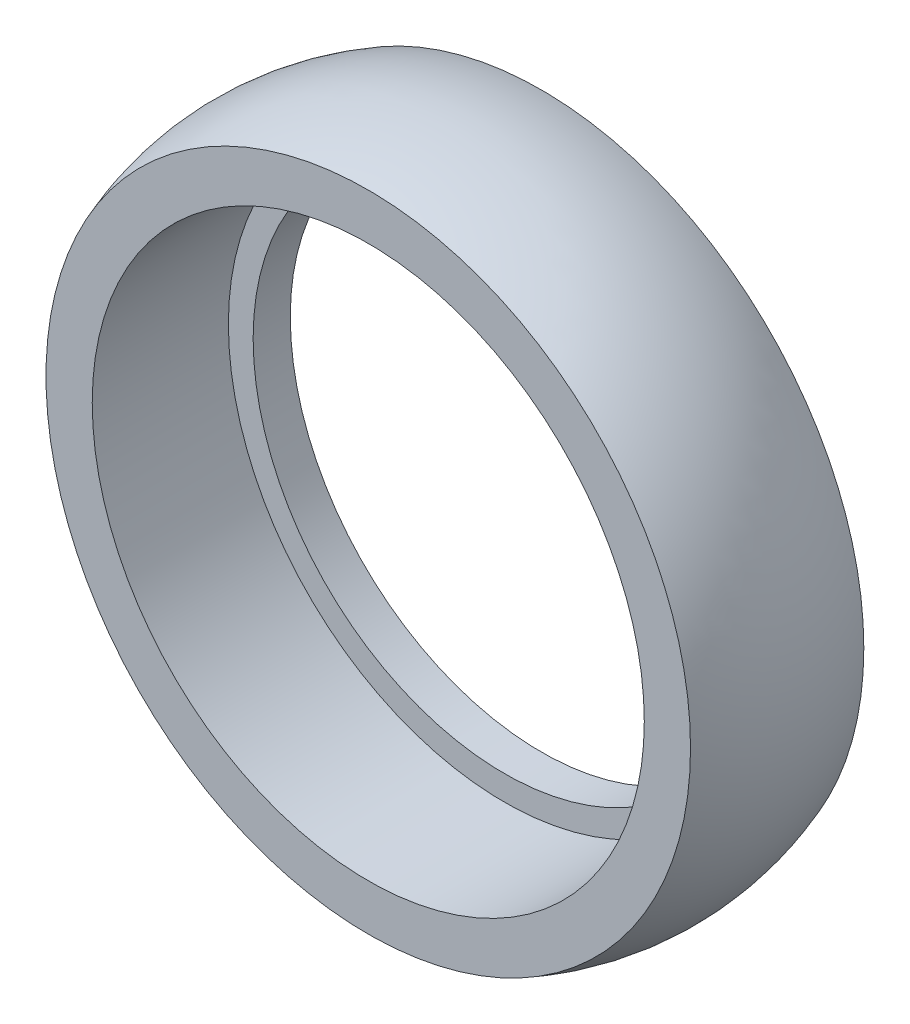
ISO-10303-21;
HEADER;
FILE_DESCRIPTION(('STEP AP214'),'2;1');
FILE_NAME('part.step','',(''),(''),'','','');
FILE_SCHEMA(('AUTOMOTIVE_DESIGN { 1 0 10303 214 1 1 1 1 }'));
ENDSEC;
DATA;
#1=APPLICATION_CONTEXT('core data for automotive mechanical design processes');
#2=APPLICATION_PROTOCOL_DEFINITION('international standard','automotive_design',2000,#1);
#3=PRODUCT_CONTEXT('',#1,'mechanical');
#4=PRODUCT('Part','Part','',(#3));
#5=PRODUCT_RELATED_PRODUCT_CATEGORY('part','',(#4));
#6=PRODUCT_DEFINITION_FORMATION('','',#4);
#7=PRODUCT_DEFINITION_CONTEXT('part definition',#1,'design');
#8=PRODUCT_DEFINITION('design','',#6,#7);
#9=PRODUCT_DEFINITION_SHAPE('','',#8);
#10=(LENGTH_UNIT() NAMED_UNIT(*) SI_UNIT(.MILLI.,.METRE.));
#11=(NAMED_UNIT(*) PLANE_ANGLE_UNIT() SI_UNIT($,.RADIAN.));
#12=(NAMED_UNIT(*) SI_UNIT($,.STERADIAN.) SOLID_ANGLE_UNIT());
#13=UNCERTAINTY_MEASURE_WITH_UNIT(LENGTH_MEASURE(1.E-05),#10,'distance_accuracy_value','');
#14=(GEOMETRIC_REPRESENTATION_CONTEXT(3) GLOBAL_UNCERTAINTY_ASSIGNED_CONTEXT((#13)) GLOBAL_UNIT_ASSIGNED_CONTEXT((#10,
#11,#12)) REPRESENTATION_CONTEXT('',''));
#15=CARTESIAN_POINT('',(0.,0.,0.));
#16=DIRECTION('',(0.,0.,1.));
#17=DIRECTION('',(1.,0.,0.));
#18=AXIS2_PLACEMENT_3D('',#15,#16,#17);
#19=CARTESIAN_POINT('',(0.,0.,3.5));
#20=DIRECTION('',(0.,0.,1.));
#21=DIRECTION('',(1.,0.,0.));
#22=AXIS2_PLACEMENT_3D('',#19,#20,#21);
#23=DEGENERATE_TOROIDAL_SURFACE('',#22,3.65,10.,.T.);
#24=CARTESIAN_POINT('',(0.,0.,7.));
#25=DIRECTION('',(0.,0.,1.));
#26=DIRECTION('',(1.,0.,0.));
#27=AXIS2_PLACEMENT_3D('',#24,#25,#26);
#28=CIRCLE('',#27,13.0174969975976);
#29=CARTESIAN_POINT('',(13.0174969975976,0.,7.));
#30=VERTEX_POINT('',#29);
#31=EDGE_CURVE('E10',#30,#30,#28,.T.);
#32=ORIENTED_EDGE('',*,*,#31,.F.);
#33=EDGE_LOOP('',(#32));
#34=FACE_BOUND('',#33,.T.);
#35=CARTESIAN_POINT('',(0.,0.,0.));
#36=DIRECTION('',(0.,0.,1.));
#37=DIRECTION('',(1.,0.,0.));
#38=AXIS2_PLACEMENT_3D('',#35,#36,#37);
#39=CIRCLE('',#38,13.0174969975976);
#40=CARTESIAN_POINT('',(13.0174969975976,0.,0.));
#41=VERTEX_POINT('',#40);
#42=EDGE_CURVE('E53',#41,#41,#39,.T.);
#43=ORIENTED_EDGE('',*,*,#42,.T.);
#44=EDGE_LOOP('',(#43));
#45=FACE_BOUND('',#44,.T.);
#46=ADVANCED_FACE('F31',(#34,#45),#23,.T.);
#47=CARTESIAN_POINT('',(0.,13.0174969975976,7.));
#48=DIRECTION('',(0.,0.,-1.));
#49=DIRECTION('',(-1.,0.,0.));
#50=AXIS2_PLACEMENT_3D('',#47,#48,#49);
#51=PLANE('',#50);
#52=CARTESIAN_POINT('',(0.,0.,7.));
#53=DIRECTION('',(0.,0.,1.));
#54=DIRECTION('',(1.,0.,0.));
#55=AXIS2_PLACEMENT_3D('',#52,#53,#54);
#56=CIRCLE('',#55,11.15);
#57=CARTESIAN_POINT('',(11.15,0.,7.));
#58=VERTEX_POINT('',#57);
#59=EDGE_CURVE('E37',#58,#58,#56,.T.);
#60=ORIENTED_EDGE('',*,*,#59,.F.);
#61=EDGE_LOOP('',(#60));
#62=FACE_BOUND('',#61,.T.);
#63=ORIENTED_EDGE('',*,*,#31,.T.);
#64=EDGE_LOOP('',(#63));
#65=FACE_BOUND('',#64,.T.);
#66=ADVANCED_FACE('F78',(#62,#65),#51,.F.);
#67=CARTESIAN_POINT('',(0.,0.,0.));
#68=DIRECTION('',(0.,0.,1.));
#69=DIRECTION('',(1.,0.,0.));
#70=AXIS2_PLACEMENT_3D('',#67,#68,#69);
#71=CYLINDRICAL_SURFACE('',#70,11.15);
#72=CARTESIAN_POINT('',(0.,0.,1.5));
#73=DIRECTION('',(0.,0.,1.));
#74=DIRECTION('',(1.,0.,0.));
#75=AXIS2_PLACEMENT_3D('',#72,#73,#74);
#76=CIRCLE('',#75,11.15);
#77=CARTESIAN_POINT('',(11.15,0.,1.5));
#78=VERTEX_POINT('',#77);
#79=EDGE_CURVE('E41',#78,#78,#76,.T.);
#80=ORIENTED_EDGE('',*,*,#79,.F.);
#81=EDGE_LOOP('',(#80));
#82=FACE_BOUND('',#81,.T.);
#83=ORIENTED_EDGE('',*,*,#59,.T.);
#84=EDGE_LOOP('',(#83));
#85=FACE_BOUND('',#84,.T.);
#86=ADVANCED_FACE('F73',(#82,#85),#71,.F.);
#87=CARTESIAN_POINT('',(0.,10.15,1.5));
#88=DIRECTION('',(0.,0.,-1.));
#89=DIRECTION('',(-1.,0.,0.));
#90=AXIS2_PLACEMENT_3D('',#87,#88,#89);
#91=PLANE('',#90);
#92=CARTESIAN_POINT('',(0.,0.,1.5));
#93=DIRECTION('',(0.,0.,1.));
#94=DIRECTION('',(1.,0.,0.));
#95=AXIS2_PLACEMENT_3D('',#92,#93,#94);
#96=CIRCLE('',#95,10.15);
#97=CARTESIAN_POINT('',(10.15,0.,1.5));
#98=VERTEX_POINT('',#97);
#99=EDGE_CURVE('E45',#98,#98,#96,.T.);
#100=ORIENTED_EDGE('',*,*,#99,.F.);
#101=EDGE_LOOP('',(#100));
#102=FACE_BOUND('',#101,.T.);
#103=ORIENTED_EDGE('',*,*,#79,.T.);
#104=EDGE_LOOP('',(#103));
#105=FACE_BOUND('',#104,.T.);
#106=ADVANCED_FACE('F67',(#102,#105),#91,.F.);
#107=CARTESIAN_POINT('',(0.,0.,0.));
#108=DIRECTION('',(0.,0.,1.));
#109=DIRECTION('',(1.,0.,0.));
#110=AXIS2_PLACEMENT_3D('',#107,#108,#109);
#111=CYLINDRICAL_SURFACE('',#110,10.15);
#112=CARTESIAN_POINT('',(0.,0.,0.));
#113=DIRECTION('',(0.,0.,1.));
#114=DIRECTION('',(1.,0.,0.));
#115=AXIS2_PLACEMENT_3D('',#112,#113,#114);
#116=CIRCLE('',#115,10.15);
#117=CARTESIAN_POINT('',(10.15,0.,0.));
#118=VERTEX_POINT('',#117);
#119=EDGE_CURVE('E50',#118,#118,#116,.T.);
#120=ORIENTED_EDGE('',*,*,#119,.F.);
#121=EDGE_LOOP('',(#120));
#122=FACE_BOUND('',#121,.T.);
#123=ORIENTED_EDGE('',*,*,#99,.T.);
#124=EDGE_LOOP('',(#123));
#125=FACE_BOUND('',#124,.T.);
#126=ADVANCED_FACE('F61',(#122,#125),#111,.F.);
#127=CARTESIAN_POINT('',(0.,13.0174969975976,0.));
#128=DIRECTION('',(0.,0.,1.));
#129=DIRECTION('',(1.,0.,0.));
#130=AXIS2_PLACEMENT_3D('',#127,#128,#129);
#131=PLANE('',#130);
#132=ORIENTED_EDGE('',*,*,#42,.F.);
#133=EDGE_LOOP('',(#132));
#134=FACE_BOUND('',#133,.T.);
#135=ORIENTED_EDGE('',*,*,#119,.T.);
#136=EDGE_LOOP('',(#135));
#137=FACE_BOUND('',#136,.T.);
#138=ADVANCED_FACE('F58',(#134,#137),#131,.F.);
#139=CLOSED_SHELL('',(#46,#66,#86,#106,#126,#138));
#140=MANIFOLD_SOLID_BREP('B2',#139);
#141=ADVANCED_BREP_SHAPE_REPRESENTATION('',(#18,#140),#14);
#142=SHAPE_DEFINITION_REPRESENTATION(#9,#141);
ENDSEC;
END-ISO-10303-21;
